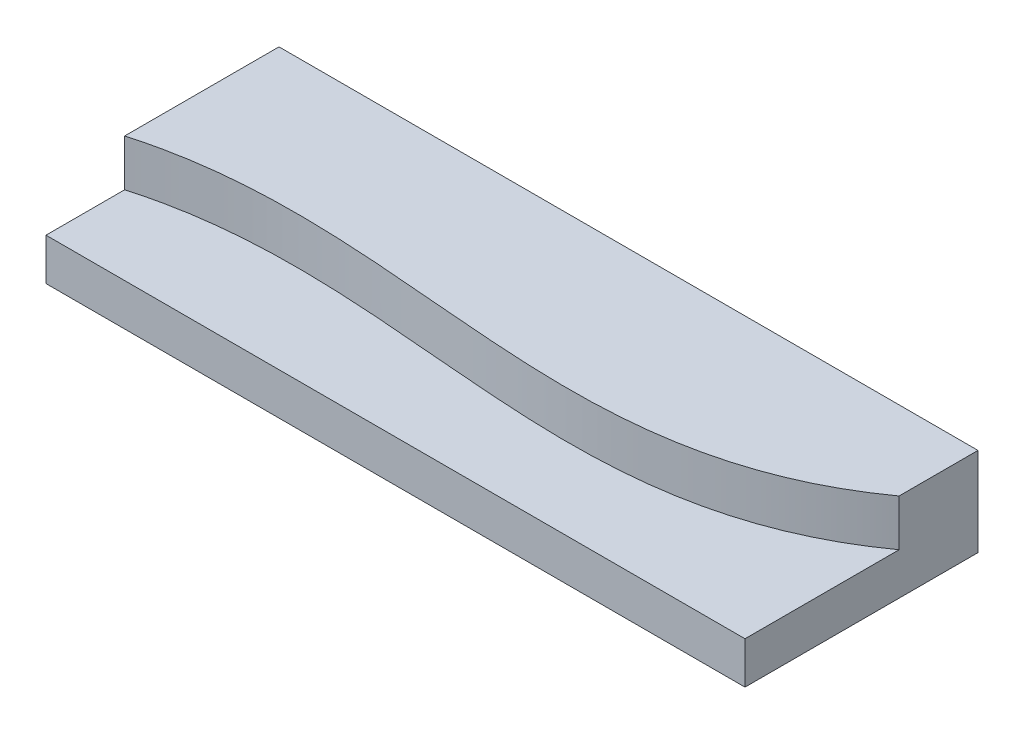
ISO-10303-21;
HEADER;
FILE_DESCRIPTION(('STEP AP214'),'2;1');
FILE_NAME('part.step','',(''),(''),'','','');
FILE_SCHEMA(('AUTOMOTIVE_DESIGN { 1 0 10303 214 1 1 1 1 }'));
ENDSEC;
DATA;
#1=APPLICATION_CONTEXT('core data for automotive mechanical design processes');
#2=APPLICATION_PROTOCOL_DEFINITION('international standard','automotive_design',2000,#1);
#3=PRODUCT_CONTEXT('',#1,'mechanical');
#4=PRODUCT('Part','Part','',(#3));
#5=PRODUCT_RELATED_PRODUCT_CATEGORY('part','',(#4));
#6=PRODUCT_DEFINITION_FORMATION('','',#4);
#7=PRODUCT_DEFINITION_CONTEXT('part definition',#1,'design');
#8=PRODUCT_DEFINITION('design','',#6,#7);
#9=PRODUCT_DEFINITION_SHAPE('','',#8);
#10=(LENGTH_UNIT() NAMED_UNIT(*) SI_UNIT(.MILLI.,.METRE.));
#11=(NAMED_UNIT(*) PLANE_ANGLE_UNIT() SI_UNIT($,.RADIAN.));
#12=(NAMED_UNIT(*) SI_UNIT($,.STERADIAN.) SOLID_ANGLE_UNIT());
#13=UNCERTAINTY_MEASURE_WITH_UNIT(LENGTH_MEASURE(1.E-05),#10,'distance_accuracy_value','');
#14=(GEOMETRIC_REPRESENTATION_CONTEXT(3) GLOBAL_UNCERTAINTY_ASSIGNED_CONTEXT((#13)) GLOBAL_UNIT_ASSIGNED_CONTEXT((#10,
#11,#12)) REPRESENTATION_CONTEXT('',''));
#15=CARTESIAN_POINT('',(0.,0.,0.));
#16=DIRECTION('',(0.,0.,1.));
#17=DIRECTION('',(1.,0.,0.));
#18=AXIS2_PLACEMENT_3D('',#15,#16,#17);
#19=CARTESIAN_POINT('',(0.,19.,0.));
#20=DIRECTION('',(0.,0.,-1.));
#21=DIRECTION('',(-1.,0.,0.));
#22=AXIS2_PLACEMENT_3D('',#19,#20,#21);
#23=PLANE('',#22);
#24=DIRECTION('',(1.,0.,0.));
#25=VECTOR('',#24,1.);
#26=CARTESIAN_POINT('',(0.,9.,0.));
#27=LINE('',#26,#25);
#28=CARTESIAN_POINT('',(0.,9.,0.));
#29=VERTEX_POINT('',#28);
#30=CARTESIAN_POINT('',(150.,9.,0.));
#31=VERTEX_POINT('',#30);
#32=EDGE_CURVE('E114',#29,#31,#27,.T.);
#33=ORIENTED_EDGE('',*,*,#32,.F.);
#34=DIRECTION('',(0.,-1.,0.));
#35=VECTOR('',#34,1.);
#36=CARTESIAN_POINT('',(0.,19.,0.));
#37=LINE('',#36,#35);
#38=CARTESIAN_POINT('',(0.,0.,0.));
#39=VERTEX_POINT('',#38);
#40=EDGE_CURVE('E123',#29,#39,#37,.T.);
#41=ORIENTED_EDGE('',*,*,#40,.T.);
#42=DIRECTION('',(1.,0.,0.));
#43=VECTOR('',#42,1.);
#44=CARTESIAN_POINT('',(0.,0.,0.));
#45=LINE('',#44,#43);
#46=CARTESIAN_POINT('',(150.,0.,0.));
#47=VERTEX_POINT('',#46);
#48=EDGE_CURVE('E109',#39,#47,#45,.T.);
#49=ORIENTED_EDGE('',*,*,#48,.T.);
#50=DIRECTION('',(0.,-1.,0.));
#51=VECTOR('',#50,1.);
#52=CARTESIAN_POINT('',(150.,19.,0.));
#53=LINE('',#52,#51);
#54=EDGE_CURVE('E121',#31,#47,#53,.T.);
#55=ORIENTED_EDGE('',*,*,#54,.F.);
#56=EDGE_LOOP('',(#33,#41,#49,#55));
#57=FACE_BOUND('',#56,.T.);
#58=ADVANCED_FACE('F43',(#57),#23,.F.);
#59=CARTESIAN_POINT('',(0.,19.,0.));
#60=DIRECTION('',(1.,0.,0.));
#61=DIRECTION('',(0.,0.,-1.));
#62=AXIS2_PLACEMENT_3D('',#59,#60,#61);
#63=PLANE('',#62);
#64=DIRECTION('',(0.,0.,1.));
#65=VECTOR('',#64,1.);
#66=CARTESIAN_POINT('',(0.,9.,0.));
#67=LINE('',#66,#65);
#68=CARTESIAN_POINT('',(-1.92641042007224E-12,9.,-16.8759092576786));
#69=VERTEX_POINT('',#68);
#70=EDGE_CURVE('E110',#69,#29,#67,.T.);
#71=ORIENTED_EDGE('',*,*,#70,.F.);
#72=DIRECTION('',(0.,1.,0.));
#73=VECTOR('',#72,1.);
#74=CARTESIAN_POINT('',(0.,9.,-16.8759092576792));
#75=LINE('',#74,#73);
#76=CARTESIAN_POINT('',(-1.92641042007224E-12,19.,-16.8759092576786));
#77=VERTEX_POINT('',#76);
#78=EDGE_CURVE('E142',#69,#77,#75,.T.);
#79=ORIENTED_EDGE('',*,*,#78,.T.);
#80=DIRECTION('',(0.,0.,1.));
#81=VECTOR('',#80,1.);
#82=CARTESIAN_POINT('',(0.,19.,0.));
#83=LINE('',#82,#81);
#84=CARTESIAN_POINT('',(0.,19.,-50.));
#85=VERTEX_POINT('',#84);
#86=EDGE_CURVE('E96',#85,#77,#83,.T.);
#87=ORIENTED_EDGE('',*,*,#86,.F.);
#88=DIRECTION('',(0.,-1.,0.));
#89=VECTOR('',#88,1.);
#90=CARTESIAN_POINT('',(0.,19.,-50.));
#91=LINE('',#90,#89);
#92=CARTESIAN_POINT('',(0.,0.,-50.));
#93=VERTEX_POINT('',#92);
#94=EDGE_CURVE('E89',#85,#93,#91,.T.);
#95=ORIENTED_EDGE('',*,*,#94,.T.);
#96=DIRECTION('',(0.,0.,1.));
#97=VECTOR('',#96,1.);
#98=CARTESIAN_POINT('',(0.,0.,0.));
#99=LINE('',#98,#97);
#100=EDGE_CURVE('E103',#93,#39,#99,.T.);
#101=ORIENTED_EDGE('',*,*,#100,.T.);
#102=ORIENTED_EDGE('',*,*,#40,.F.);
#103=EDGE_LOOP('',(#71,#79,#87,#95,#101,#102));
#104=FACE_BOUND('',#103,.T.);
#105=ADVANCED_FACE('F45',(#104),#63,.F.);
#106=CARTESIAN_POINT('',(150.,19.,0.));
#107=DIRECTION('',(-1.,0.,0.));
#108=DIRECTION('',(0.,0.,1.));
#109=AXIS2_PLACEMENT_3D('',#106,#107,#108);
#110=PLANE('',#109);
#111=DIRECTION('',(0.,0.,-1.));
#112=VECTOR('',#111,1.);
#113=CARTESIAN_POINT('',(150.,19.,0.));
#114=LINE('',#113,#112);
#115=CARTESIAN_POINT('',(150.,19.,-33.0660137400551));
#116=VERTEX_POINT('',#115);
#117=CARTESIAN_POINT('',(150.,19.,-50.));
#118=VERTEX_POINT('',#117);
#119=EDGE_CURVE('E131',#116,#118,#114,.T.);
#120=ORIENTED_EDGE('',*,*,#119,.F.);
#121=DIRECTION('',(0.,1.,0.));
#122=VECTOR('',#121,1.);
#123=CARTESIAN_POINT('',(150.,9.,-33.0660137400036));
#124=LINE('',#123,#122);
#125=CARTESIAN_POINT('',(150.000000000072,9.,-33.0660137400551));
#126=VERTEX_POINT('',#125);
#127=EDGE_CURVE('E58',#116,#126,#124,.F.);
#128=ORIENTED_EDGE('',*,*,#127,.T.);
#129=DIRECTION('',(0.,0.,-1.));
#130=VECTOR('',#129,1.);
#131=CARTESIAN_POINT('',(150.,9.,0.));
#132=LINE('',#131,#130);
#133=EDGE_CURVE('E11',#31,#126,#132,.T.);
#134=ORIENTED_EDGE('',*,*,#133,.F.);
#135=ORIENTED_EDGE('',*,*,#54,.T.);
#136=DIRECTION('',(0.,0.,-1.));
#137=VECTOR('',#136,1.);
#138=CARTESIAN_POINT('',(150.,0.,0.));
#139=LINE('',#138,#137);
#140=CARTESIAN_POINT('',(150.,0.,-50.));
#141=VERTEX_POINT('',#140);
#142=EDGE_CURVE('E97',#47,#141,#139,.T.);
#143=ORIENTED_EDGE('',*,*,#142,.T.);
#144=DIRECTION('',(0.,-1.,0.));
#145=VECTOR('',#144,1.);
#146=CARTESIAN_POINT('',(150.,19.,-50.));
#147=LINE('',#146,#145);
#148=EDGE_CURVE('E92',#118,#141,#147,.T.);
#149=ORIENTED_EDGE('',*,*,#148,.F.);
#150=EDGE_LOOP('',(#120,#128,#134,#135,#143,#149));
#151=FACE_BOUND('',#150,.T.);
#152=ADVANCED_FACE('F135',(#151),#110,.F.);
#153=CARTESIAN_POINT('',(0.,19.,-50.));
#154=DIRECTION('',(0.,0.,1.));
#155=DIRECTION('',(1.,0.,0.));
#156=AXIS2_PLACEMENT_3D('',#153,#154,#155);
#157=PLANE('',#156);
#158=DIRECTION('',(-1.,0.,0.));
#159=VECTOR('',#158,1.);
#160=CARTESIAN_POINT('',(0.,0.,-50.));
#161=LINE('',#160,#159);
#162=EDGE_CURVE('E86',#141,#93,#161,.T.);
#163=ORIENTED_EDGE('',*,*,#162,.T.);
#164=ORIENTED_EDGE('',*,*,#94,.F.);
#165=DIRECTION('',(-1.,0.,0.));
#166=VECTOR('',#165,1.);
#167=CARTESIAN_POINT('',(0.,19.,-50.));
#168=LINE('',#167,#166);
#169=EDGE_CURVE('E67',#118,#85,#168,.T.);
#170=ORIENTED_EDGE('',*,*,#169,.F.);
#171=ORIENTED_EDGE('',*,*,#148,.T.);
#172=EDGE_LOOP('',(#163,#164,#170,#171));
#173=FACE_BOUND('',#172,.T.);
#174=ADVANCED_FACE('F88',(#173),#157,.F.);
#175=CARTESIAN_POINT('',(0.,19.,0.));
#176=DIRECTION('',(0.,-1.,0.));
#177=DIRECTION('',(0.,0.,-1.));
#178=AXIS2_PLACEMENT_3D('',#175,#176,#177);
#179=PLANE('',#178);
#180=ORIENTED_EDGE('',*,*,#86,.T.);
#181=CARTESIAN_POINT('',(161.6193725196,19.,-43.1646852628099));
#182=CARTESIAN_POINT('',(110.750368017602,19.,9.28938003652909));
#183=CARTESIAN_POINT('',(43.4068275758398,19.,-39.6998941811981));
#184=CARTESIAN_POINT('',(-14.1576691502109,19.,-11.4359773801726));
#185=B_SPLINE_CURVE_WITH_KNOTS('',3,(#181,#182,#183,#184),.UNSPECIFIED.,.F.,.F.,(4,4),(0.,1.),.UNSPECIFIED.);
#186=EDGE_CURVE('E51',#77,#116,#185,.F.);
#187=ORIENTED_EDGE('',*,*,#186,.T.);
#188=ORIENTED_EDGE('',*,*,#119,.T.);
#189=ORIENTED_EDGE('',*,*,#169,.T.);
#190=EDGE_LOOP('',(#180,#187,#188,#189));
#191=FACE_BOUND('',#190,.T.);
#192=ADVANCED_FACE('F130',(#191),#179,.F.);
#193=CARTESIAN_POINT('',(0.,0.,0.));
#194=DIRECTION('',(0.,-1.,0.));
#195=DIRECTION('',(0.,0.,-1.));
#196=AXIS2_PLACEMENT_3D('',#193,#194,#195);
#197=PLANE('',#196);
#198=ORIENTED_EDGE('',*,*,#100,.F.);
#199=ORIENTED_EDGE('',*,*,#162,.F.);
#200=ORIENTED_EDGE('',*,*,#142,.F.);
#201=ORIENTED_EDGE('',*,*,#48,.F.);
#202=EDGE_LOOP('',(#198,#199,#200,#201));
#203=FACE_BOUND('',#202,.T.);
#204=ADVANCED_FACE('F107',(#203),#197,.T.);
#205=CARTESIAN_POINT('',(76.2416612687141,9.,-18.2290256346237));
#206=DIRECTION('',(0.,1.,0.));
#207=DIRECTION('',(0.,0.,1.));
#208=AXIS2_PLACEMENT_3D('',#205,#206,#207);
#209=PLANE('',#208);
#210=ORIENTED_EDGE('',*,*,#70,.T.);
#211=ORIENTED_EDGE('',*,*,#32,.T.);
#212=ORIENTED_EDGE('',*,*,#133,.T.);
#213=CARTESIAN_POINT('',(161.6193725196,9.,-43.1646852628099));
#214=CARTESIAN_POINT('',(110.750368017602,9.,9.28938003652909));
#215=CARTESIAN_POINT('',(43.4068275758398,9.,-39.6998941811981));
#216=CARTESIAN_POINT('',(-14.1576691502109,9.,-11.4359773801726));
#217=B_SPLINE_CURVE_WITH_KNOTS('',3,(#213,#214,#215,#216),.UNSPECIFIED.,.F.,.F.,(4,4),(0.,1.),.UNSPECIFIED.);
#218=EDGE_CURVE('E145',#126,#69,#217,.T.);
#219=ORIENTED_EDGE('',*,*,#218,.T.);
#220=EDGE_LOOP('',(#210,#211,#212,#219));
#221=FACE_BOUND('',#220,.T.);
#222=ADVANCED_FACE('F158',(#221),#209,.T.);
#223=DIRECTION('',(0.,1.,0.));
#224=VECTOR('',#223,1.);
#225=SURFACE_OF_LINEAR_EXTRUSION('',#217,#224);
#226=ORIENTED_EDGE('',*,*,#218,.F.);
#227=ORIENTED_EDGE('',*,*,#127,.F.);
#228=ORIENTED_EDGE('',*,*,#186,.F.);
#229=ORIENTED_EDGE('',*,*,#78,.F.);
#230=EDGE_LOOP('',(#226,#227,#228,#229));
#231=FACE_BOUND('',#230,.T.);
#232=ADVANCED_FACE('F154',(#231),#225,.F.);
#233=CLOSED_SHELL('',(#58,#105,#152,#174,#192,#204,#222,#232));
#234=MANIFOLD_SOLID_BREP('B2',#233);
#235=ADVANCED_BREP_SHAPE_REPRESENTATION('',(#18,#234),#14);
#236=SHAPE_DEFINITION_REPRESENTATION(#9,#235);
ENDSEC;
END-ISO-10303-21;
